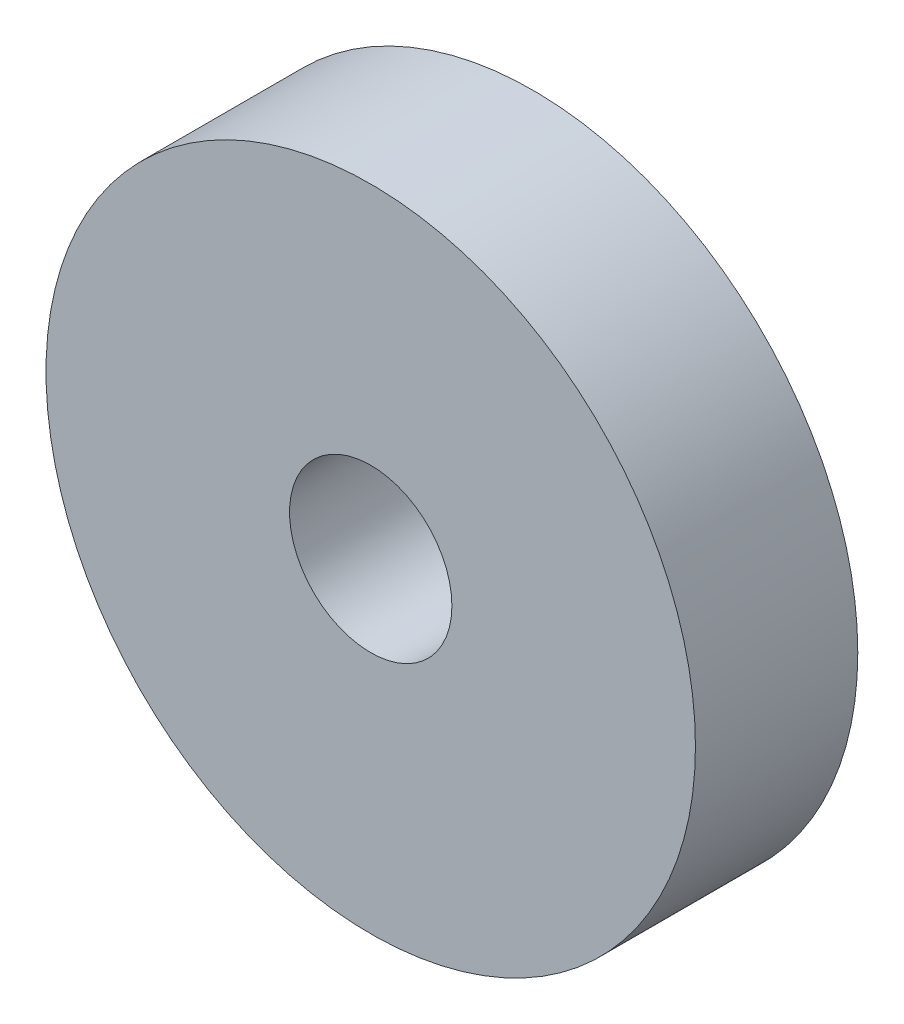
ISO-10303-21;
HEADER;
FILE_DESCRIPTION(('STEP AP214'),'2;1');
FILE_NAME('part.step','',(''),(''),'','','');
FILE_SCHEMA(('AUTOMOTIVE_DESIGN { 1 0 10303 214 1 1 1 1 }'));
ENDSEC;
DATA;
#1=APPLICATION_CONTEXT('core data for automotive mechanical design processes');
#2=APPLICATION_PROTOCOL_DEFINITION('international standard','automotive_design',2000,#1);
#3=PRODUCT_CONTEXT('',#1,'mechanical');
#4=PRODUCT('Part','Part','',(#3));
#5=PRODUCT_RELATED_PRODUCT_CATEGORY('part','',(#4));
#6=PRODUCT_DEFINITION_FORMATION('','',#4);
#7=PRODUCT_DEFINITION_CONTEXT('part definition',#1,'design');
#8=PRODUCT_DEFINITION('design','',#6,#7);
#9=PRODUCT_DEFINITION_SHAPE('','',#8);
#10=(LENGTH_UNIT() NAMED_UNIT(*) SI_UNIT(.MILLI.,.METRE.));
#11=(NAMED_UNIT(*) PLANE_ANGLE_UNIT() SI_UNIT($,.RADIAN.));
#12=(NAMED_UNIT(*) SI_UNIT($,.STERADIAN.) SOLID_ANGLE_UNIT());
#13=UNCERTAINTY_MEASURE_WITH_UNIT(LENGTH_MEASURE(1.E-05),#10,'distance_accuracy_value','');
#14=(GEOMETRIC_REPRESENTATION_CONTEXT(3) GLOBAL_UNCERTAINTY_ASSIGNED_CONTEXT((#13)) GLOBAL_UNIT_ASSIGNED_CONTEXT((#10,
#11,#12)) REPRESENTATION_CONTEXT('',''));
#15=CARTESIAN_POINT('',(0.,0.,0.));
#16=DIRECTION('',(0.,0.,1.));
#17=DIRECTION('',(1.,0.,0.));
#18=AXIS2_PLACEMENT_3D('',#15,#16,#17);
#19=CARTESIAN_POINT('',(0.,0.,5.));
#20=DIRECTION('',(0.,0.,1.));
#21=DIRECTION('',(1.,0.,0.));
#22=AXIS2_PLACEMENT_3D('',#19,#20,#21);
#23=PLANE('',#22);
#24=CARTESIAN_POINT('',(0.,0.,5.));
#25=DIRECTION('',(0.,0.,1.));
#26=DIRECTION('',(1.,0.,0.));
#27=AXIS2_PLACEMENT_3D('',#24,#25,#26);
#28=CIRCLE('',#27,10.);
#29=CARTESIAN_POINT('',(10.,0.,5.));
#30=VERTEX_POINT('',#29);
#31=EDGE_CURVE('E10',#30,#30,#28,.T.);
#32=ORIENTED_EDGE('',*,*,#31,.T.);
#33=EDGE_LOOP('',(#32));
#34=FACE_BOUND('',#33,.T.);
#35=CARTESIAN_POINT('',(0.,0.,5.));
#36=DIRECTION('',(0.,0.,1.));
#37=DIRECTION('',(1.,0.,0.));
#38=AXIS2_PLACEMENT_3D('',#35,#36,#37);
#39=CIRCLE('',#38,2.5);
#40=CARTESIAN_POINT('',(2.5,0.,5.));
#41=VERTEX_POINT('',#40);
#42=EDGE_CURVE('E50',#41,#41,#39,.T.);
#43=ORIENTED_EDGE('',*,*,#42,.F.);
#44=EDGE_LOOP('',(#43));
#45=FACE_BOUND('',#44,.T.);
#46=ADVANCED_FACE('F37',(#34,#45),#23,.T.);
#47=CARTESIAN_POINT('',(0.,0.,0.));
#48=DIRECTION('',(0.,0.,1.));
#49=DIRECTION('',(1.,0.,0.));
#50=AXIS2_PLACEMENT_3D('',#47,#48,#49);
#51=PLANE('',#50);
#52=CARTESIAN_POINT('',(0.,0.,0.));
#53=DIRECTION('',(0.,0.,1.));
#54=DIRECTION('',(1.,0.,0.));
#55=AXIS2_PLACEMENT_3D('',#52,#53,#54);
#56=CIRCLE('',#55,10.);
#57=CARTESIAN_POINT('',(10.,0.,0.));
#58=VERTEX_POINT('',#57);
#59=EDGE_CURVE('E41',#58,#58,#56,.T.);
#60=ORIENTED_EDGE('',*,*,#59,.F.);
#61=EDGE_LOOP('',(#60));
#62=FACE_BOUND('',#61,.T.);
#63=CARTESIAN_POINT('',(0.,0.,0.));
#64=DIRECTION('',(0.,0.,1.));
#65=DIRECTION('',(1.,0.,0.));
#66=AXIS2_PLACEMENT_3D('',#63,#64,#65);
#67=CIRCLE('',#66,2.5);
#68=CARTESIAN_POINT('',(2.5,0.,0.));
#69=VERTEX_POINT('',#68);
#70=EDGE_CURVE('E52',#69,#69,#67,.T.);
#71=ORIENTED_EDGE('',*,*,#70,.T.);
#72=EDGE_LOOP('',(#71));
#73=FACE_BOUND('',#72,.T.);
#74=ADVANCED_FACE('F64',(#62,#73),#51,.F.);
#75=CARTESIAN_POINT('',(0.,0.,5.));
#76=DIRECTION('',(0.,0.,-1.));
#77=DIRECTION('',(-1.,0.,0.));
#78=AXIS2_PLACEMENT_3D('',#75,#76,#77);
#79=CYLINDRICAL_SURFACE('',#78,10.);
#80=ORIENTED_EDGE('',*,*,#31,.F.);
#81=EDGE_LOOP('',(#80));
#82=FACE_BOUND('',#81,.T.);
#83=ORIENTED_EDGE('',*,*,#59,.T.);
#84=EDGE_LOOP('',(#83));
#85=FACE_BOUND('',#84,.T.);
#86=ADVANCED_FACE('F39',(#82,#85),#79,.T.);
#87=CARTESIAN_POINT('',(0.,0.,5.));
#88=DIRECTION('',(0.,0.,-1.));
#89=DIRECTION('',(-1.,0.,0.));
#90=AXIS2_PLACEMENT_3D('',#87,#88,#89);
#91=CYLINDRICAL_SURFACE('',#90,2.5);
#92=ORIENTED_EDGE('',*,*,#42,.T.);
#93=EDGE_LOOP('',(#92));
#94=FACE_BOUND('',#93,.T.);
#95=ORIENTED_EDGE('',*,*,#70,.F.);
#96=EDGE_LOOP('',(#95));
#97=FACE_BOUND('',#96,.T.);
#98=ADVANCED_FACE('F60',(#94,#97),#91,.F.);
#99=CLOSED_SHELL('',(#46,#74,#86,#98));
#100=MANIFOLD_SOLID_BREP('B2',#99);
#101=ADVANCED_BREP_SHAPE_REPRESENTATION('',(#18,#100),#14);
#102=SHAPE_DEFINITION_REPRESENTATION(#9,#101);
ENDSEC;
END-ISO-10303-21;
